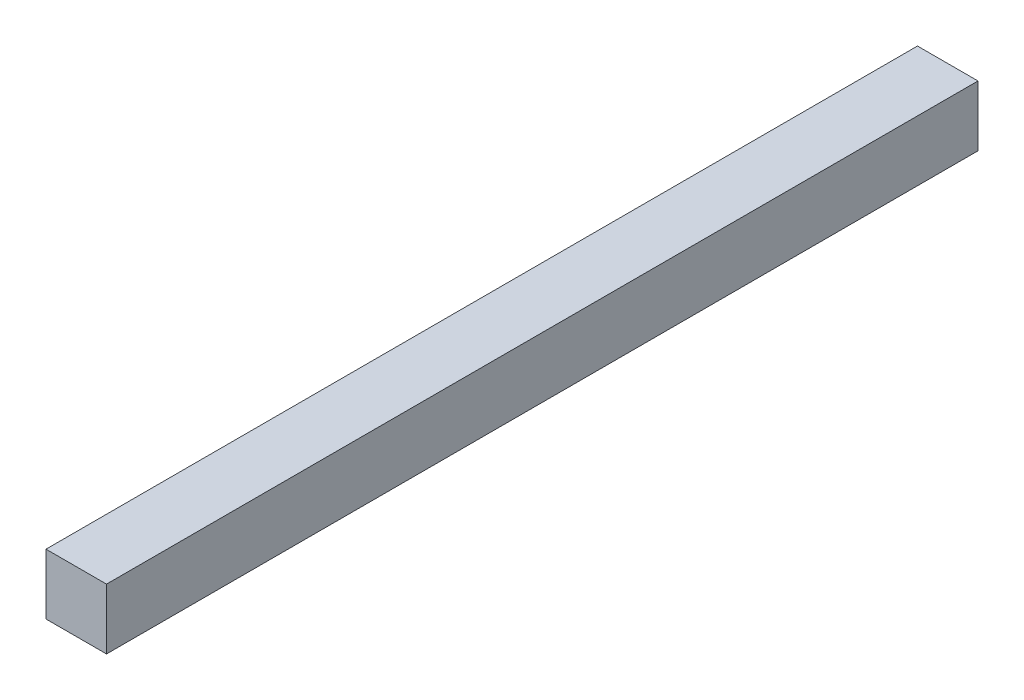
ISO-10303-21;
HEADER;
FILE_DESCRIPTION(('STEP AP214'),'2;1');
FILE_NAME('part.step','',(''),(''),'','','');
FILE_SCHEMA(('AUTOMOTIVE_DESIGN { 1 0 10303 214 1 1 1 1 }'));
ENDSEC;
DATA;
#1=APPLICATION_CONTEXT('core data for automotive mechanical design processes');
#2=APPLICATION_PROTOCOL_DEFINITION('international standard','automotive_design',2000,#1);
#3=PRODUCT_CONTEXT('',#1,'mechanical');
#4=PRODUCT('Part','Part','',(#3));
#5=PRODUCT_RELATED_PRODUCT_CATEGORY('part','',(#4));
#6=PRODUCT_DEFINITION_FORMATION('','',#4);
#7=PRODUCT_DEFINITION_CONTEXT('part definition',#1,'design');
#8=PRODUCT_DEFINITION('design','',#6,#7);
#9=PRODUCT_DEFINITION_SHAPE('','',#8);
#10=(LENGTH_UNIT() NAMED_UNIT(*) SI_UNIT(.MILLI.,.METRE.));
#11=(NAMED_UNIT(*) PLANE_ANGLE_UNIT() SI_UNIT($,.RADIAN.));
#12=(NAMED_UNIT(*) SI_UNIT($,.STERADIAN.) SOLID_ANGLE_UNIT());
#13=UNCERTAINTY_MEASURE_WITH_UNIT(LENGTH_MEASURE(1.E-05),#10,'distance_accuracy_value','');
#14=(GEOMETRIC_REPRESENTATION_CONTEXT(3) GLOBAL_UNCERTAINTY_ASSIGNED_CONTEXT((#13)) GLOBAL_UNIT_ASSIGNED_CONTEXT((#10,
#11,#12)) REPRESENTATION_CONTEXT('',''));
#15=CARTESIAN_POINT('',(0.,0.,0.));
#16=DIRECTION('',(0.,0.,1.));
#17=DIRECTION('',(1.,0.,0.));
#18=AXIS2_PLACEMENT_3D('',#15,#16,#17);
#19=CARTESIAN_POINT('',(27.6704081221256,7.50600505689002,91.44));
#20=DIRECTION('',(1.,0.,0.));
#21=DIRECTION('',(0.,0.,-1.));
#22=AXIS2_PLACEMENT_3D('',#19,#20,#21);
#23=PLANE('',#22);
#24=DIRECTION('',(0.,-1.,0.));
#25=VECTOR('',#24,1.);
#26=CARTESIAN_POINT('',(27.6704081221256,7.50600505689002,0.));
#27=LINE('',#26,#25);
#28=CARTESIAN_POINT('',(27.6704081221256,13.85600505689,0.));
#29=VERTEX_POINT('',#28);
#30=CARTESIAN_POINT('',(27.6704081221256,7.50600505689002,0.));
#31=VERTEX_POINT('',#30);
#32=EDGE_CURVE('E111',#29,#31,#27,.T.);
#33=ORIENTED_EDGE('',*,*,#32,.T.);
#34=DIRECTION('',(0.,0.,-1.));
#35=VECTOR('',#34,1.);
#36=CARTESIAN_POINT('',(27.6704081221256,7.50600505689002,91.44));
#37=LINE('',#36,#35);
#38=CARTESIAN_POINT('',(27.6704081221256,7.50600505689002,91.44));
#39=VERTEX_POINT('',#38);
#40=EDGE_CURVE('E11',#39,#31,#37,.T.);
#41=ORIENTED_EDGE('',*,*,#40,.F.);
#42=DIRECTION('',(0.,-1.,0.));
#43=VECTOR('',#42,1.);
#44=CARTESIAN_POINT('',(27.6704081221256,7.50600505689002,91.44));
#45=LINE('',#44,#43);
#46=CARTESIAN_POINT('',(27.6704081221256,13.85600505689,91.44));
#47=VERTEX_POINT('',#46);
#48=EDGE_CURVE('E95',#47,#39,#45,.T.);
#49=ORIENTED_EDGE('',*,*,#48,.F.);
#50=DIRECTION('',(0.,0.,-1.));
#51=VECTOR('',#50,1.);
#52=CARTESIAN_POINT('',(27.6704081221256,13.85600505689,91.44));
#53=LINE('',#52,#51);
#54=EDGE_CURVE('E107',#47,#29,#53,.T.);
#55=ORIENTED_EDGE('',*,*,#54,.T.);
#56=EDGE_LOOP('',(#33,#41,#49,#55));
#57=FACE_BOUND('',#56,.T.);
#58=ADVANCED_FACE('F43',(#57),#23,.F.);
#59=CARTESIAN_POINT('',(27.6704081221256,7.50600505689002,91.44));
#60=DIRECTION('',(0.,1.,0.));
#61=DIRECTION('',(0.,0.,1.));
#62=AXIS2_PLACEMENT_3D('',#59,#60,#61);
#63=PLANE('',#62);
#64=DIRECTION('',(1.,0.,0.));
#65=VECTOR('',#64,1.);
#66=CARTESIAN_POINT('',(27.6704081221256,7.50600505689002,0.));
#67=LINE('',#66,#65);
#68=CARTESIAN_POINT('',(34.0204081221256,7.50600505689002,0.));
#69=VERTEX_POINT('',#68);
#70=EDGE_CURVE('E100',#31,#69,#67,.T.);
#71=ORIENTED_EDGE('',*,*,#70,.T.);
#72=DIRECTION('',(0.,0.,-1.));
#73=VECTOR('',#72,1.);
#74=CARTESIAN_POINT('',(34.0204081221256,7.50600505689002,91.44));
#75=LINE('',#74,#73);
#76=CARTESIAN_POINT('',(34.0204081221256,7.50600505689002,91.44));
#77=VERTEX_POINT('',#76);
#78=EDGE_CURVE('E52',#77,#69,#75,.T.);
#79=ORIENTED_EDGE('',*,*,#78,.F.);
#80=DIRECTION('',(1.,0.,0.));
#81=VECTOR('',#80,1.);
#82=CARTESIAN_POINT('',(27.6704081221256,7.50600505689002,91.44));
#83=LINE('',#82,#81);
#84=EDGE_CURVE('E90',#39,#77,#83,.T.);
#85=ORIENTED_EDGE('',*,*,#84,.F.);
#86=ORIENTED_EDGE('',*,*,#40,.T.);
#87=EDGE_LOOP('',(#71,#79,#85,#86));
#88=FACE_BOUND('',#87,.T.);
#89=ADVANCED_FACE('F99',(#88),#63,.F.);
#90=CARTESIAN_POINT('',(34.0204081221256,7.50600505689002,91.44));
#91=DIRECTION('',(-1.,0.,0.));
#92=DIRECTION('',(0.,0.,1.));
#93=AXIS2_PLACEMENT_3D('',#90,#91,#92);
#94=PLANE('',#93);
#95=DIRECTION('',(0.,1.,0.));
#96=VECTOR('',#95,1.);
#97=CARTESIAN_POINT('',(34.0204081221256,7.50600505689002,0.));
#98=LINE('',#97,#96);
#99=CARTESIAN_POINT('',(34.0204081221256,13.85600505689,0.));
#100=VERTEX_POINT('',#99);
#101=EDGE_CURVE('E77',#69,#100,#98,.T.);
#102=ORIENTED_EDGE('',*,*,#101,.T.);
#103=DIRECTION('',(0.,0.,-1.));
#104=VECTOR('',#103,1.);
#105=CARTESIAN_POINT('',(34.0204081221256,13.85600505689,91.44));
#106=LINE('',#105,#104);
#107=CARTESIAN_POINT('',(34.0204081221256,13.85600505689,91.44));
#108=VERTEX_POINT('',#107);
#109=EDGE_CURVE('E102',#108,#100,#106,.T.);
#110=ORIENTED_EDGE('',*,*,#109,.F.);
#111=DIRECTION('',(0.,1.,0.));
#112=VECTOR('',#111,1.);
#113=CARTESIAN_POINT('',(34.0204081221256,7.50600505689002,91.44));
#114=LINE('',#113,#112);
#115=EDGE_CURVE('E93',#77,#108,#114,.T.);
#116=ORIENTED_EDGE('',*,*,#115,.F.);
#117=ORIENTED_EDGE('',*,*,#78,.T.);
#118=EDGE_LOOP('',(#102,#110,#116,#117));
#119=FACE_BOUND('',#118,.T.);
#120=ADVANCED_FACE('F103',(#119),#94,.F.);
#121=CARTESIAN_POINT('',(27.6704081221256,13.85600505689,91.44));
#122=DIRECTION('',(0.,-1.,0.));
#123=DIRECTION('',(0.,0.,-1.));
#124=AXIS2_PLACEMENT_3D('',#121,#122,#123);
#125=PLANE('',#124);
#126=DIRECTION('',(-1.,0.,0.));
#127=VECTOR('',#126,1.);
#128=CARTESIAN_POINT('',(27.6704081221256,13.85600505689,0.));
#129=LINE('',#128,#127);
#130=EDGE_CURVE('E83',#100,#29,#129,.T.);
#131=ORIENTED_EDGE('',*,*,#130,.T.);
#132=ORIENTED_EDGE('',*,*,#54,.F.);
#133=DIRECTION('',(-1.,0.,0.));
#134=VECTOR('',#133,1.);
#135=CARTESIAN_POINT('',(27.6704081221256,13.85600505689,91.44));
#136=LINE('',#135,#134);
#137=EDGE_CURVE('E60',#108,#47,#136,.T.);
#138=ORIENTED_EDGE('',*,*,#137,.F.);
#139=ORIENTED_EDGE('',*,*,#109,.T.);
#140=EDGE_LOOP('',(#131,#132,#138,#139));
#141=FACE_BOUND('',#140,.T.);
#142=ADVANCED_FACE('F124',(#141),#125,.F.);
#143=CARTESIAN_POINT('',(0.,0.,91.44));
#144=DIRECTION('',(0.,0.,-1.));
#145=DIRECTION('',(-1.,0.,0.));
#146=AXIS2_PLACEMENT_3D('',#143,#144,#145);
#147=PLANE('',#146);
#148=ORIENTED_EDGE('',*,*,#48,.T.);
#149=ORIENTED_EDGE('',*,*,#84,.T.);
#150=ORIENTED_EDGE('',*,*,#115,.T.);
#151=ORIENTED_EDGE('',*,*,#137,.T.);
#152=EDGE_LOOP('',(#148,#149,#150,#151));
#153=FACE_BOUND('',#152,.T.);
#154=ADVANCED_FACE('F91',(#153),#147,.F.);
#155=CARTESIAN_POINT('',(0.,0.,0.));
#156=DIRECTION('',(0.,0.,-1.));
#157=DIRECTION('',(-1.,0.,0.));
#158=AXIS2_PLACEMENT_3D('',#155,#156,#157);
#159=PLANE('',#158);
#160=ORIENTED_EDGE('',*,*,#32,.F.);
#161=ORIENTED_EDGE('',*,*,#130,.F.);
#162=ORIENTED_EDGE('',*,*,#101,.F.);
#163=ORIENTED_EDGE('',*,*,#70,.F.);
#164=EDGE_LOOP('',(#160,#161,#162,#163));
#165=FACE_BOUND('',#164,.T.);
#166=ADVANCED_FACE('F127',(#165),#159,.T.);
#167=CLOSED_SHELL('',(#58,#89,#120,#142,#154,#166));
#168=MANIFOLD_SOLID_BREP('B2',#167);
#169=ADVANCED_BREP_SHAPE_REPRESENTATION('',(#18,#168),#14);
#170=SHAPE_DEFINITION_REPRESENTATION(#9,#169);
ENDSEC;
END-ISO-10303-21;
